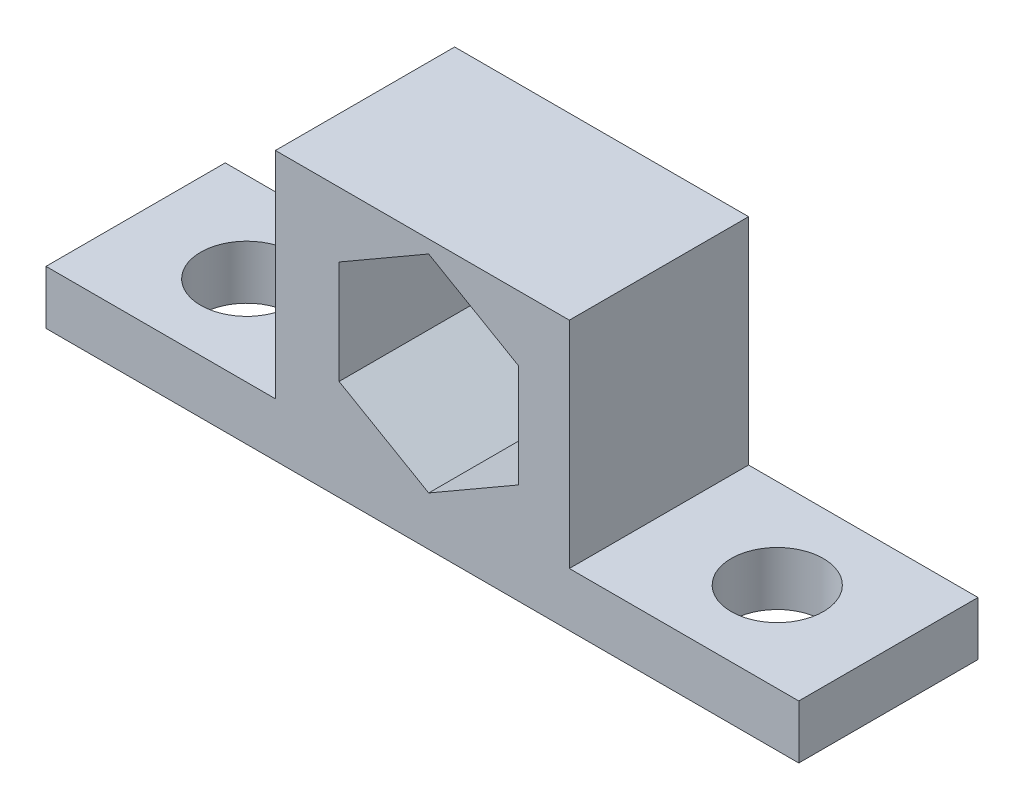
ISO-10303-21;
HEADER;
FILE_DESCRIPTION(('STEP AP214'),'2;1');
FILE_NAME('part.step','',(''),(''),'','','');
FILE_SCHEMA(('AUTOMOTIVE_DESIGN { 1 0 10303 214 1 1 1 1 }'));
ENDSEC;
DATA;
#1=APPLICATION_CONTEXT('core data for automotive mechanical design processes');
#2=APPLICATION_PROTOCOL_DEFINITION('international standard','automotive_design',2000,#1);
#3=PRODUCT_CONTEXT('',#1,'mechanical');
#4=PRODUCT('Part','Part','',(#3));
#5=PRODUCT_RELATED_PRODUCT_CATEGORY('part','',(#4));
#6=PRODUCT_DEFINITION_FORMATION('','',#4);
#7=PRODUCT_DEFINITION_CONTEXT('part definition',#1,'design');
#8=PRODUCT_DEFINITION('design','',#6,#7);
#9=PRODUCT_DEFINITION_SHAPE('','',#8);
#10=(LENGTH_UNIT() NAMED_UNIT(*) SI_UNIT(.MILLI.,.METRE.));
#11=(NAMED_UNIT(*) PLANE_ANGLE_UNIT() SI_UNIT($,.RADIAN.));
#12=(NAMED_UNIT(*) SI_UNIT($,.STERADIAN.) SOLID_ANGLE_UNIT());
#13=UNCERTAINTY_MEASURE_WITH_UNIT(LENGTH_MEASURE(1.E-05),#10,'distance_accuracy_value','');
#14=(GEOMETRIC_REPRESENTATION_CONTEXT(3) GLOBAL_UNCERTAINTY_ASSIGNED_CONTEXT((#13)) GLOBAL_UNIT_ASSIGNED_CONTEXT((#10,
#11,#12)) REPRESENTATION_CONTEXT('',''));
#15=CARTESIAN_POINT('',(0.,0.,0.));
#16=DIRECTION('',(0.,0.,1.));
#17=DIRECTION('',(1.,0.,0.));
#18=AXIS2_PLACEMENT_3D('',#15,#16,#17);
#19=CARTESIAN_POINT('',(0.,3.81,0.));
#20=DIRECTION('',(0.,1.,0.));
#21=DIRECTION('',(0.,0.,1.));
#22=AXIS2_PLACEMENT_3D('',#19,#20,#21);
#23=PLANE('',#22);
#24=DIRECTION('',(0.,0.,1.));
#25=VECTOR('',#24,1.);
#26=CARTESIAN_POINT('',(-19.1250455281497,3.81,9.58609075441454));
#27=LINE('',#26,#25);
#28=CARTESIAN_POINT('',(-19.1250455281497,3.81,-3.11390924558546));
#29=VERTEX_POINT('',#28);
#30=CARTESIAN_POINT('',(-19.1250455281497,3.81,9.58609075441454));
#31=VERTEX_POINT('',#30);
#32=EDGE_CURVE('E143',#29,#31,#27,.T.);
#33=ORIENTED_EDGE('',*,*,#32,.F.);
#34=DIRECTION('',(1.,0.,0.));
#35=VECTOR('',#34,1.);
#36=CARTESIAN_POINT('',(0.,3.81,-3.11390924558546));
#37=LINE('',#36,#35);
#38=CARTESIAN_POINT('',(-35.3810455281497,3.81,-3.11390924558546));
#39=VERTEX_POINT('',#38);
#40=EDGE_CURVE('E271',#39,#29,#37,.T.);
#41=ORIENTED_EDGE('',*,*,#40,.F.);
#42=DIRECTION('',(0.,0.,1.));
#43=VECTOR('',#42,1.);
#44=CARTESIAN_POINT('',(-35.3810455281497,3.81,0.));
#45=LINE('',#44,#43);
#46=CARTESIAN_POINT('',(-35.3810455281497,3.81,9.58609075441454));
#47=VERTEX_POINT('',#46);
#48=EDGE_CURVE('E269',#39,#47,#45,.T.);
#49=ORIENTED_EDGE('',*,*,#48,.T.);
#50=DIRECTION('',(1.,0.,0.));
#51=VECTOR('',#50,1.);
#52=CARTESIAN_POINT('',(0.,3.81,9.58609075441454));
#53=LINE('',#52,#51);
#54=EDGE_CURVE('E256',#47,#31,#53,.T.);
#55=ORIENTED_EDGE('',*,*,#54,.T.);
#56=EDGE_LOOP('',(#33,#41,#49,#55));
#57=FACE_BOUND('',#56,.T.);
#58=CARTESIAN_POINT('',(-27.5070455281497,3.81,3.23609075441454));
#59=DIRECTION('',(0.,1.,0.));
#60=DIRECTION('',(0.,0.,1.));
#61=AXIS2_PLACEMENT_3D('',#58,#59,#60);
#62=CIRCLE('',#61,3.2639);
#63=CARTESIAN_POINT('',(-27.5070455281497,3.81,6.49999075441454));
#64=VERTEX_POINT('',#63);
#65=EDGE_CURVE('E249',#64,#64,#62,.T.);
#66=ORIENTED_EDGE('',*,*,#65,.F.);
#67=EDGE_LOOP('',(#66));
#68=FACE_BOUND('',#67,.T.);
#69=ADVANCED_FACE('F35',(#57,#68),#23,.T.);
#70=CARTESIAN_POINT('',(0.,3.81,9.58609075441454));
#71=DIRECTION('',(0.,0.,-1.));
#72=DIRECTION('',(-1.,0.,0.));
#73=AXIS2_PLACEMENT_3D('',#70,#71,#72);
#74=PLANE('',#73);
#75=DIRECTION('',(-0.866025403784439,-0.5,0.));
#76=VECTOR('',#75,1.);
#77=CARTESIAN_POINT('',(-8.2627691464694,18.1273484187083,9.58609075441454));
#78=LINE('',#77,#76);
#79=CARTESIAN_POINT('',(-8.2627691464694,18.1273484187083,9.58609075441454));
#80=VERTEX_POINT('',#79);
#81=CARTESIAN_POINT('',(-14.6127691464694,14.4611742093541,9.58609075441454));
#82=VERTEX_POINT('',#81);
#83=EDGE_CURVE('E157',#80,#82,#78,.T.);
#84=ORIENTED_EDGE('',*,*,#83,.F.);
#85=DIRECTION('',(-0.866025403784439,0.5,0.));
#86=VECTOR('',#85,1.);
#87=CARTESIAN_POINT('',(-1.9127691464694,14.4611742093541,9.58609075441454));
#88=LINE('',#87,#86);
#89=CARTESIAN_POINT('',(-1.9127691464694,14.4611742093541,9.58609075441454));
#90=VERTEX_POINT('',#89);
#91=EDGE_CURVE('E52',#90,#80,#88,.T.);
#92=ORIENTED_EDGE('',*,*,#91,.F.);
#93=DIRECTION('',(0.,1.,0.));
#94=VECTOR('',#93,1.);
#95=CARTESIAN_POINT('',(-1.9127691464694,7.12882579064588,9.58609075441454));
#96=LINE('',#95,#94);
#97=CARTESIAN_POINT('',(-1.9127691464694,7.12882579064588,9.58609075441454));
#98=VERTEX_POINT('',#97);
#99=EDGE_CURVE('E149',#98,#90,#96,.T.);
#100=ORIENTED_EDGE('',*,*,#99,.F.);
#101=DIRECTION('',(0.866025403784439,0.5,0.));
#102=VECTOR('',#101,1.);
#103=CARTESIAN_POINT('',(-8.2627691464694,3.46265158129175,9.58609075441454));
#104=LINE('',#103,#102);
#105=CARTESIAN_POINT('',(-8.2627691464694,3.46265158129175,9.58609075441454));
#106=VERTEX_POINT('',#105);
#107=EDGE_CURVE('E170',#106,#98,#104,.T.);
#108=ORIENTED_EDGE('',*,*,#107,.F.);
#109=DIRECTION('',(0.866025403784439,-0.5,0.));
#110=VECTOR('',#109,1.);
#111=CARTESIAN_POINT('',(-14.6127691464694,7.12882579064587,9.58609075441454));
#112=LINE('',#111,#110);
#113=CARTESIAN_POINT('',(-14.6127691464694,7.12882579064587,9.58609075441454));
#114=VERTEX_POINT('',#113);
#115=EDGE_CURVE('E167',#114,#106,#112,.T.);
#116=ORIENTED_EDGE('',*,*,#115,.F.);
#117=DIRECTION('',(0.,-1.,0.));
#118=VECTOR('',#117,1.);
#119=CARTESIAN_POINT('',(-14.6127691464694,14.4611742093541,9.58609075441454));
#120=LINE('',#119,#118);
#121=EDGE_CURVE('E164',#82,#114,#120,.T.);
#122=ORIENTED_EDGE('',*,*,#121,.F.);
#123=EDGE_LOOP('',(#84,#92,#100,#108,#116,#122));
#124=FACE_BOUND('',#123,.T.);
#125=DIRECTION('',(1.,0.,0.));
#126=VECTOR('',#125,1.);
#127=CARTESIAN_POINT('',(0.,0.,9.58609075441454));
#128=LINE('',#127,#126);
#129=CARTESIAN_POINT('',(-35.3810455281497,0.,9.58609075441454));
#130=VERTEX_POINT('',#129);
#131=CARTESIAN_POINT('',(17.9589544718503,0.,9.58609075441454));
#132=VERTEX_POINT('',#131);
#133=EDGE_CURVE('E228',#130,#132,#128,.T.);
#134=ORIENTED_EDGE('',*,*,#133,.T.);
#135=DIRECTION('',(0.,-1.,0.));
#136=VECTOR('',#135,1.);
#137=CARTESIAN_POINT('',(17.9589544718503,3.81,9.58609075441454));
#138=LINE('',#137,#136);
#139=CARTESIAN_POINT('',(17.9589544718503,3.81,9.58609075441454));
#140=VERTEX_POINT('',#139);
#141=EDGE_CURVE('E11',#140,#132,#138,.T.);
#142=ORIENTED_EDGE('',*,*,#141,.F.);
#143=CARTESIAN_POINT('',(1.70295447185026,3.81,9.58609075441454));
#144=VERTEX_POINT('',#143);
#145=EDGE_CURVE('E260',#144,#140,#53,.T.);
#146=ORIENTED_EDGE('',*,*,#145,.F.);
#147=DIRECTION('',(0.,-1.,0.));
#148=VECTOR('',#147,1.);
#149=CARTESIAN_POINT('',(1.70295447185026,19.05,9.58609075441454));
#150=LINE('',#149,#148);
#151=CARTESIAN_POINT('',(1.70295447185026,19.05,9.58609075441454));
#152=VERTEX_POINT('',#151);
#153=EDGE_CURVE('E209',#152,#144,#150,.T.);
#154=ORIENTED_EDGE('',*,*,#153,.F.);
#155=DIRECTION('',(1.,0.,0.));
#156=VECTOR('',#155,1.);
#157=CARTESIAN_POINT('',(-19.1250455281497,19.05,9.58609075441454));
#158=LINE('',#157,#156);
#159=CARTESIAN_POINT('',(-19.1250455281497,19.05,9.58609075441454));
#160=VERTEX_POINT('',#159);
#161=EDGE_CURVE('E186',#160,#152,#158,.T.);
#162=ORIENTED_EDGE('',*,*,#161,.F.);
#163=DIRECTION('',(0.,-1.,0.));
#164=VECTOR('',#163,1.);
#165=CARTESIAN_POINT('',(-19.1250455281497,19.05,9.58609075441454));
#166=LINE('',#165,#164);
#167=EDGE_CURVE('E214',#160,#31,#166,.T.);
#168=ORIENTED_EDGE('',*,*,#167,.T.);
#169=ORIENTED_EDGE('',*,*,#54,.F.);
#170=DIRECTION('',(0.,-1.,0.));
#171=VECTOR('',#170,1.);
#172=CARTESIAN_POINT('',(-35.3810455281497,3.81,9.58609075441454));
#173=LINE('',#172,#171);
#174=EDGE_CURVE('E250',#47,#130,#173,.T.);
#175=ORIENTED_EDGE('',*,*,#174,.T.);
#176=EDGE_LOOP('',(#134,#142,#146,#154,#162,#168,#169,#175));
#177=FACE_BOUND('',#176,.T.);
#178=ADVANCED_FACE('F287',(#124,#177),#74,.F.);
#179=CARTESIAN_POINT('',(17.9589544718503,3.81,0.));
#180=DIRECTION('',(1.,0.,0.));
#181=DIRECTION('',(0.,0.,-1.));
#182=AXIS2_PLACEMENT_3D('',#179,#180,#181);
#183=PLANE('',#182);
#184=DIRECTION('',(0.,0.,1.));
#185=VECTOR('',#184,1.);
#186=CARTESIAN_POINT('',(17.9589544718503,0.,0.));
#187=LINE('',#186,#185);
#188=CARTESIAN_POINT('',(17.9589544718503,0.,-3.11390924558546));
#189=VERTEX_POINT('',#188);
#190=EDGE_CURVE('E233',#189,#132,#187,.T.);
#191=ORIENTED_EDGE('',*,*,#190,.F.);
#192=DIRECTION('',(0.,-1.,0.));
#193=VECTOR('',#192,1.);
#194=CARTESIAN_POINT('',(17.9589544718503,3.81,-3.11390924558546));
#195=LINE('',#194,#193);
#196=CARTESIAN_POINT('',(17.9589544718503,3.81,-3.11390924558546));
#197=VERTEX_POINT('',#196);
#198=EDGE_CURVE('E44',#197,#189,#195,.T.);
#199=ORIENTED_EDGE('',*,*,#198,.F.);
#200=DIRECTION('',(0.,0.,1.));
#201=VECTOR('',#200,1.);
#202=CARTESIAN_POINT('',(17.9589544718503,3.81,0.));
#203=LINE('',#202,#201);
#204=EDGE_CURVE('E259',#197,#140,#203,.T.);
#205=ORIENTED_EDGE('',*,*,#204,.T.);
#206=ORIENTED_EDGE('',*,*,#141,.T.);
#207=EDGE_LOOP('',(#191,#199,#205,#206));
#208=FACE_BOUND('',#207,.T.);
#209=ADVANCED_FACE('F281',(#208),#183,.T.);
#210=CARTESIAN_POINT('',(0.,3.81,-3.11390924558546));
#211=DIRECTION('',(0.,0.,-1.));
#212=DIRECTION('',(-1.,0.,0.));
#213=AXIS2_PLACEMENT_3D('',#210,#211,#212);
#214=PLANE('',#213);
#215=DIRECTION('',(-0.866025403784439,0.5,0.));
#216=VECTOR('',#215,1.);
#217=CARTESIAN_POINT('',(-1.9127691464694,14.4611742093541,-3.11390924558546));
#218=LINE('',#217,#216);
#219=CARTESIAN_POINT('',(-1.9127691464694,14.4611742093541,-3.11390924558546));
#220=VERTEX_POINT('',#219);
#221=CARTESIAN_POINT('',(-8.2627691464694,18.1273484187083,-3.11390924558546));
#222=VERTEX_POINT('',#221);
#223=EDGE_CURVE('E147',#220,#222,#218,.T.);
#224=ORIENTED_EDGE('',*,*,#223,.T.);
#225=DIRECTION('',(-0.866025403784439,-0.5,0.));
#226=VECTOR('',#225,1.);
#227=CARTESIAN_POINT('',(-8.2627691464694,18.1273484187083,-3.11390924558546));
#228=LINE('',#227,#226);
#229=CARTESIAN_POINT('',(-14.6127691464694,14.4611742093541,-3.11390924558546));
#230=VERTEX_POINT('',#229);
#231=EDGE_CURVE('E136',#222,#230,#228,.T.);
#232=ORIENTED_EDGE('',*,*,#231,.T.);
#233=DIRECTION('',(0.,-1.,0.));
#234=VECTOR('',#233,1.);
#235=CARTESIAN_POINT('',(-14.6127691464694,14.4611742093541,-3.11390924558546));
#236=LINE('',#235,#234);
#237=CARTESIAN_POINT('',(-14.6127691464694,7.12882579064587,-3.11390924558546));
#238=VERTEX_POINT('',#237);
#239=EDGE_CURVE('E481',#230,#238,#236,.T.);
#240=ORIENTED_EDGE('',*,*,#239,.T.);
#241=DIRECTION('',(0.866025403784439,-0.5,0.));
#242=VECTOR('',#241,1.);
#243=CARTESIAN_POINT('',(-14.6127691464694,7.12882579064587,-3.11390924558546));
#244=LINE('',#243,#242);
#245=CARTESIAN_POINT('',(-8.2627691464694,3.46265158129175,-3.11390924558546));
#246=VERTEX_POINT('',#245);
#247=EDGE_CURVE('E486',#238,#246,#244,.T.);
#248=ORIENTED_EDGE('',*,*,#247,.T.);
#249=DIRECTION('',(0.866025403784439,0.5,0.));
#250=VECTOR('',#249,1.);
#251=CARTESIAN_POINT('',(-8.2627691464694,3.46265158129175,-3.11390924558546));
#252=LINE('',#251,#250);
#253=CARTESIAN_POINT('',(-1.9127691464694,7.12882579064588,-3.11390924558546));
#254=VERTEX_POINT('',#253);
#255=EDGE_CURVE('E159',#246,#254,#252,.T.);
#256=ORIENTED_EDGE('',*,*,#255,.T.);
#257=DIRECTION('',(0.,1.,0.));
#258=VECTOR('',#257,1.);
#259=CARTESIAN_POINT('',(-1.9127691464694,7.12882579064588,-3.11390924558546));
#260=LINE('',#259,#258);
#261=EDGE_CURVE('E155',#254,#220,#260,.T.);
#262=ORIENTED_EDGE('',*,*,#261,.T.);
#263=EDGE_LOOP('',(#224,#232,#240,#248,#256,#262));
#264=FACE_BOUND('',#263,.T.);
#265=DIRECTION('',(1.,0.,0.));
#266=VECTOR('',#265,1.);
#267=CARTESIAN_POINT('',(0.,0.,-3.11390924558546));
#268=LINE('',#267,#266);
#269=CARTESIAN_POINT('',(-35.3810455281497,0.,-3.11390924558546));
#270=VERTEX_POINT('',#269);
#271=EDGE_CURVE('E241',#270,#189,#268,.T.);
#272=ORIENTED_EDGE('',*,*,#271,.F.);
#273=DIRECTION('',(0.,-1.,0.));
#274=VECTOR('',#273,1.);
#275=CARTESIAN_POINT('',(-35.3810455281497,3.81,-3.11390924558546));
#276=LINE('',#275,#274);
#277=EDGE_CURVE('E253',#39,#270,#276,.T.);
#278=ORIENTED_EDGE('',*,*,#277,.F.);
#279=ORIENTED_EDGE('',*,*,#40,.T.);
#280=DIRECTION('',(0.,-1.,0.));
#281=VECTOR('',#280,1.);
#282=CARTESIAN_POINT('',(-19.1250455281497,19.05,-3.11390924558546));
#283=LINE('',#282,#281);
#284=CARTESIAN_POINT('',(-19.1250455281497,19.05,-3.11390924558546));
#285=VERTEX_POINT('',#284);
#286=EDGE_CURVE('E193',#285,#29,#283,.T.);
#287=ORIENTED_EDGE('',*,*,#286,.F.);
#288=DIRECTION('',(-1.,0.,0.));
#289=VECTOR('',#288,1.);
#290=CARTESIAN_POINT('',(-19.1250455281497,19.05,-3.11390924558546));
#291=LINE('',#290,#289);
#292=CARTESIAN_POINT('',(1.70295447185026,19.05,-3.11390924558546));
#293=VERTEX_POINT('',#292);
#294=EDGE_CURVE('E191',#293,#285,#291,.T.);
#295=ORIENTED_EDGE('',*,*,#294,.F.);
#296=DIRECTION('',(0.,-1.,0.));
#297=VECTOR('',#296,1.);
#298=CARTESIAN_POINT('',(1.70295447185026,19.05,-3.11390924558546));
#299=LINE('',#298,#297);
#300=CARTESIAN_POINT('',(1.70295447185026,3.81,-3.11390924558546));
#301=VERTEX_POINT('',#300);
#302=EDGE_CURVE('E204',#293,#301,#299,.T.);
#303=ORIENTED_EDGE('',*,*,#302,.T.);
#304=EDGE_CURVE('E267',#301,#197,#37,.T.);
#305=ORIENTED_EDGE('',*,*,#304,.T.);
#306=ORIENTED_EDGE('',*,*,#198,.T.);
#307=EDGE_LOOP('',(#272,#278,#279,#287,#295,#303,#305,#306));
#308=FACE_BOUND('',#307,.T.);
#309=ADVANCED_FACE('F152',(#264,#308),#214,.T.);
#310=CARTESIAN_POINT('',(-35.3810455281497,3.81,0.));
#311=DIRECTION('',(1.,0.,0.));
#312=DIRECTION('',(0.,0.,-1.));
#313=AXIS2_PLACEMENT_3D('',#310,#311,#312);
#314=PLANE('',#313);
#315=DIRECTION('',(0.,0.,1.));
#316=VECTOR('',#315,1.);
#317=CARTESIAN_POINT('',(-35.3810455281497,0.,0.));
#318=LINE('',#317,#316);
#319=EDGE_CURVE('E244',#270,#130,#318,.T.);
#320=ORIENTED_EDGE('',*,*,#319,.T.);
#321=ORIENTED_EDGE('',*,*,#174,.F.);
#322=ORIENTED_EDGE('',*,*,#48,.F.);
#323=ORIENTED_EDGE('',*,*,#277,.T.);
#324=EDGE_LOOP('',(#320,#321,#322,#323));
#325=FACE_BOUND('',#324,.T.);
#326=ADVANCED_FACE('F296',(#325),#314,.F.);
#327=CARTESIAN_POINT('',(-27.5070455281497,3.81,3.23609075441454));
#328=DIRECTION('',(0.,-1.,0.));
#329=DIRECTION('',(0.,0.,-1.));
#330=AXIS2_PLACEMENT_3D('',#327,#328,#329);
#331=CYLINDRICAL_SURFACE('',#330,3.2639);
#332=ORIENTED_EDGE('',*,*,#65,.T.);
#333=EDGE_LOOP('',(#332));
#334=FACE_BOUND('',#333,.T.);
#335=CARTESIAN_POINT('',(-27.5070455281497,0.,3.23609075441454));
#336=DIRECTION('',(0.,1.,0.));
#337=DIRECTION('',(0.,0.,1.));
#338=AXIS2_PLACEMENT_3D('',#335,#336,#337);
#339=CIRCLE('',#338,3.2639);
#340=CARTESIAN_POINT('',(-27.5070455281497,0.,6.49999075441454));
#341=VERTEX_POINT('',#340);
#342=EDGE_CURVE('E223',#341,#341,#339,.T.);
#343=ORIENTED_EDGE('',*,*,#342,.F.);
#344=EDGE_LOOP('',(#343));
#345=FACE_BOUND('',#344,.T.);
#346=ADVANCED_FACE('F37',(#334,#345),#331,.F.);
#347=CARTESIAN_POINT('',(10.0849544718503,3.81,3.23609075441454));
#348=DIRECTION('',(0.,-1.,0.));
#349=DIRECTION('',(0.,0.,-1.));
#350=AXIS2_PLACEMENT_3D('',#347,#348,#349);
#351=CYLINDRICAL_SURFACE('',#350,3.26390000000001);
#352=CARTESIAN_POINT('',(10.0849544718503,3.81,3.23609075441454));
#353=DIRECTION('',(0.,1.,0.));
#354=DIRECTION('',(0.,0.,1.));
#355=AXIS2_PLACEMENT_3D('',#352,#353,#354);
#356=CIRCLE('',#355,3.26390000000001);
#357=CARTESIAN_POINT('',(10.0849544718503,3.81,6.49999075441455));
#358=VERTEX_POINT('',#357);
#359=EDGE_CURVE('E236',#358,#358,#356,.T.);
#360=ORIENTED_EDGE('',*,*,#359,.T.);
#361=EDGE_LOOP('',(#360));
#362=FACE_BOUND('',#361,.T.);
#363=CARTESIAN_POINT('',(10.0849544718503,0.,3.23609075441454));
#364=DIRECTION('',(0.,1.,0.));
#365=DIRECTION('',(0.,0.,1.));
#366=AXIS2_PLACEMENT_3D('',#363,#364,#365);
#367=CIRCLE('',#366,3.26390000000001);
#368=CARTESIAN_POINT('',(10.0849544718503,0.,6.49999075441455));
#369=VERTEX_POINT('',#368);
#370=EDGE_CURVE('E246',#369,#369,#367,.T.);
#371=ORIENTED_EDGE('',*,*,#370,.F.);
#372=EDGE_LOOP('',(#371));
#373=FACE_BOUND('',#372,.T.);
#374=ADVANCED_FACE('F321',(#362,#373),#351,.F.);
#375=DIRECTION('',(0.,0.,-1.));
#376=VECTOR('',#375,1.);
#377=CARTESIAN_POINT('',(1.70295447185026,3.81,9.58609075441454));
#378=LINE('',#377,#376);
#379=EDGE_CURVE('E187',#144,#301,#378,.T.);
#380=ORIENTED_EDGE('',*,*,#379,.F.);
#381=ORIENTED_EDGE('',*,*,#145,.T.);
#382=ORIENTED_EDGE('',*,*,#204,.F.);
#383=ORIENTED_EDGE('',*,*,#304,.F.);
#384=EDGE_LOOP('',(#380,#381,#382,#383));
#385=FACE_BOUND('',#384,.T.);
#386=ORIENTED_EDGE('',*,*,#359,.F.);
#387=EDGE_LOOP('',(#386));
#388=FACE_BOUND('',#387,.T.);
#389=ADVANCED_FACE('F282',(#385,#388),#23,.T.);
#390=CARTESIAN_POINT('',(0.,0.,0.));
#391=DIRECTION('',(0.,1.,0.));
#392=DIRECTION('',(0.,0.,1.));
#393=AXIS2_PLACEMENT_3D('',#390,#391,#392);
#394=PLANE('',#393);
#395=ORIENTED_EDGE('',*,*,#342,.T.);
#396=EDGE_LOOP('',(#395));
#397=FACE_BOUND('',#396,.T.);
#398=ORIENTED_EDGE('',*,*,#133,.F.);
#399=ORIENTED_EDGE('',*,*,#319,.F.);
#400=ORIENTED_EDGE('',*,*,#271,.T.);
#401=ORIENTED_EDGE('',*,*,#190,.T.);
#402=EDGE_LOOP('',(#398,#399,#400,#401));
#403=FACE_BOUND('',#402,.T.);
#404=ORIENTED_EDGE('',*,*,#370,.T.);
#405=EDGE_LOOP('',(#404));
#406=FACE_BOUND('',#405,.T.);
#407=ADVANCED_FACE('F292',(#397,#403,#406),#394,.F.);
#408=CARTESIAN_POINT('',(-19.1250455281497,19.05,9.58609075441454));
#409=DIRECTION('',(1.,0.,0.));
#410=DIRECTION('',(0.,0.,-1.));
#411=AXIS2_PLACEMENT_3D('',#408,#409,#410);
#412=PLANE('',#411);
#413=ORIENTED_EDGE('',*,*,#32,.T.);
#414=ORIENTED_EDGE('',*,*,#167,.F.);
#415=DIRECTION('',(0.,0.,1.));
#416=VECTOR('',#415,1.);
#417=CARTESIAN_POINT('',(-19.1250455281497,19.05,9.58609075441454));
#418=LINE('',#417,#416);
#419=EDGE_CURVE('E183',#285,#160,#418,.T.);
#420=ORIENTED_EDGE('',*,*,#419,.F.);
#421=ORIENTED_EDGE('',*,*,#286,.T.);
#422=EDGE_LOOP('',(#413,#414,#420,#421));
#423=FACE_BOUND('',#422,.T.);
#424=ADVANCED_FACE('F299',(#423),#412,.F.);
#425=CARTESIAN_POINT('',(1.70295447185026,19.05,9.58609075441454));
#426=DIRECTION('',(-1.,0.,0.));
#427=DIRECTION('',(0.,0.,1.));
#428=AXIS2_PLACEMENT_3D('',#425,#426,#427);
#429=PLANE('',#428);
#430=ORIENTED_EDGE('',*,*,#379,.T.);
#431=ORIENTED_EDGE('',*,*,#302,.F.);
#432=DIRECTION('',(0.,0.,-1.));
#433=VECTOR('',#432,1.);
#434=CARTESIAN_POINT('',(1.70295447185026,19.05,9.58609075441454));
#435=LINE('',#434,#433);
#436=EDGE_CURVE('E189',#152,#293,#435,.T.);
#437=ORIENTED_EDGE('',*,*,#436,.F.);
#438=ORIENTED_EDGE('',*,*,#153,.T.);
#439=EDGE_LOOP('',(#430,#431,#437,#438));
#440=FACE_BOUND('',#439,.T.);
#441=ADVANCED_FACE('F304',(#440),#429,.F.);
#442=CARTESIAN_POINT('',(0.,19.05,0.));
#443=DIRECTION('',(0.,-1.,0.));
#444=DIRECTION('',(0.,0.,-1.));
#445=AXIS2_PLACEMENT_3D('',#442,#443,#444);
#446=PLANE('',#445);
#447=ORIENTED_EDGE('',*,*,#419,.T.);
#448=ORIENTED_EDGE('',*,*,#161,.T.);
#449=ORIENTED_EDGE('',*,*,#436,.T.);
#450=ORIENTED_EDGE('',*,*,#294,.T.);
#451=EDGE_LOOP('',(#447,#448,#449,#450));
#452=FACE_BOUND('',#451,.T.);
#453=ADVANCED_FACE('F301',(#452),#446,.F.);
#454=CARTESIAN_POINT('',(-1.9127691464694,14.4611742093541,-3.11495924558546));
#455=DIRECTION('',(0.5,0.866025403784439,0.));
#456=DIRECTION('',(-0.866025403784439,0.5,0.));
#457=AXIS2_PLACEMENT_3D('',#454,#455,#456);
#458=PLANE('',#457);
#459=DIRECTION('',(0.,0.,1.));
#460=VECTOR('',#459,1.);
#461=CARTESIAN_POINT('',(-1.9127691464694,14.4611742093541,-3.11495924558546));
#462=LINE('',#461,#460);
#463=EDGE_CURVE('E144',#220,#90,#462,.T.);
#464=ORIENTED_EDGE('',*,*,#463,.T.);
#465=ORIENTED_EDGE('',*,*,#91,.T.);
#466=DIRECTION('',(0.,0.,1.));
#467=VECTOR('',#466,1.);
#468=CARTESIAN_POINT('',(-8.2627691464694,18.1273484187083,-3.11495924558546));
#469=LINE('',#468,#467);
#470=EDGE_CURVE('E138',#222,#80,#469,.T.);
#471=ORIENTED_EDGE('',*,*,#470,.F.);
#472=ORIENTED_EDGE('',*,*,#223,.F.);
#473=EDGE_LOOP('',(#464,#465,#471,#472));
#474=FACE_BOUND('',#473,.T.);
#475=ADVANCED_FACE('F146',(#474),#458,.F.);
#476=CARTESIAN_POINT('',(-1.9127691464694,7.12882579064588,-3.11495924558546));
#477=DIRECTION('',(1.,0.,0.));
#478=DIRECTION('',(0.,1.,0.));
#479=AXIS2_PLACEMENT_3D('',#476,#477,#478);
#480=PLANE('',#479);
#481=DIRECTION('',(0.,0.,1.));
#482=VECTOR('',#481,1.);
#483=CARTESIAN_POINT('',(-1.9127691464694,7.12882579064588,-3.11495924558546));
#484=LINE('',#483,#482);
#485=EDGE_CURVE('E176',#254,#98,#484,.T.);
#486=ORIENTED_EDGE('',*,*,#485,.T.);
#487=ORIENTED_EDGE('',*,*,#99,.T.);
#488=ORIENTED_EDGE('',*,*,#463,.F.);
#489=ORIENTED_EDGE('',*,*,#261,.F.);
#490=EDGE_LOOP('',(#486,#487,#488,#489));
#491=FACE_BOUND('',#490,.T.);
#492=ADVANCED_FACE('F427',(#491),#480,.F.);
#493=CARTESIAN_POINT('',(-8.2627691464694,3.46265158129175,-3.11495924558546));
#494=DIRECTION('',(0.5,-0.866025403784439,0.));
#495=DIRECTION('',(0.866025403784439,0.5,0.));
#496=AXIS2_PLACEMENT_3D('',#493,#494,#495);
#497=PLANE('',#496);
#498=DIRECTION('',(0.,0.,1.));
#499=VECTOR('',#498,1.);
#500=CARTESIAN_POINT('',(-8.2627691464694,3.46265158129175,-3.11495924558546));
#501=LINE('',#500,#499);
#502=EDGE_CURVE('E178',#246,#106,#501,.T.);
#503=ORIENTED_EDGE('',*,*,#502,.T.);
#504=ORIENTED_EDGE('',*,*,#107,.T.);
#505=ORIENTED_EDGE('',*,*,#485,.F.);
#506=ORIENTED_EDGE('',*,*,#255,.F.);
#507=EDGE_LOOP('',(#503,#504,#505,#506));
#508=FACE_BOUND('',#507,.T.);
#509=ADVANCED_FACE('F433',(#508),#497,.F.);
#510=CARTESIAN_POINT('',(-14.6127691464694,7.12882579064587,-3.11495924558546));
#511=DIRECTION('',(-0.5,-0.866025403784439,0.));
#512=DIRECTION('',(0.866025403784439,-0.5,0.));
#513=AXIS2_PLACEMENT_3D('',#510,#511,#512);
#514=PLANE('',#513);
#515=DIRECTION('',(0.,0.,1.));
#516=VECTOR('',#515,1.);
#517=CARTESIAN_POINT('',(-14.6127691464694,7.12882579064587,-3.11495924558546));
#518=LINE('',#517,#516);
#519=EDGE_CURVE('E180',#238,#114,#518,.T.);
#520=ORIENTED_EDGE('',*,*,#519,.T.);
#521=ORIENTED_EDGE('',*,*,#115,.T.);
#522=ORIENTED_EDGE('',*,*,#502,.F.);
#523=ORIENTED_EDGE('',*,*,#247,.F.);
#524=EDGE_LOOP('',(#520,#521,#522,#523));
#525=FACE_BOUND('',#524,.T.);
#526=ADVANCED_FACE('F441',(#525),#514,.F.);
#527=CARTESIAN_POINT('',(-14.6127691464694,14.4611742093541,-3.11495924558546));
#528=DIRECTION('',(-1.,0.,0.));
#529=DIRECTION('',(0.,0.,1.));
#530=AXIS2_PLACEMENT_3D('',#527,#528,#529);
#531=PLANE('',#530);
#532=DIRECTION('',(0.,0.,1.));
#533=VECTOR('',#532,1.);
#534=CARTESIAN_POINT('',(-14.6127691464694,14.4611742093541,-3.11495924558546));
#535=LINE('',#534,#533);
#536=EDGE_CURVE('E60',#230,#82,#535,.T.);
#537=ORIENTED_EDGE('',*,*,#536,.T.);
#538=ORIENTED_EDGE('',*,*,#121,.T.);
#539=ORIENTED_EDGE('',*,*,#519,.F.);
#540=ORIENTED_EDGE('',*,*,#239,.F.);
#541=EDGE_LOOP('',(#537,#538,#539,#540));
#542=FACE_BOUND('',#541,.T.);
#543=ADVANCED_FACE('F449',(#542),#531,.F.);
#544=CARTESIAN_POINT('',(-8.2627691464694,18.1273484187083,-3.11495924558546));
#545=DIRECTION('',(-0.5,0.866025403784439,0.));
#546=DIRECTION('',(-0.866025403784439,-0.5,0.));
#547=AXIS2_PLACEMENT_3D('',#544,#545,#546);
#548=PLANE('',#547);
#549=ORIENTED_EDGE('',*,*,#470,.T.);
#550=ORIENTED_EDGE('',*,*,#83,.T.);
#551=ORIENTED_EDGE('',*,*,#536,.F.);
#552=ORIENTED_EDGE('',*,*,#231,.F.);
#553=EDGE_LOOP('',(#549,#550,#551,#552));
#554=FACE_BOUND('',#553,.T.);
#555=ADVANCED_FACE('F137',(#554),#548,.F.);
#556=CLOSED_SHELL('',(#69,#178,#209,#309,#326,#346,#374,#389,#407,#424,#441,#453,#475,#492,#509,
#526,#543,#555));
#557=MANIFOLD_SOLID_BREP('B2',#556);
#558=ADVANCED_BREP_SHAPE_REPRESENTATION('',(#18,#557),#14);
#559=SHAPE_DEFINITION_REPRESENTATION(#9,#558);
ENDSEC;
END-ISO-10303-21;
